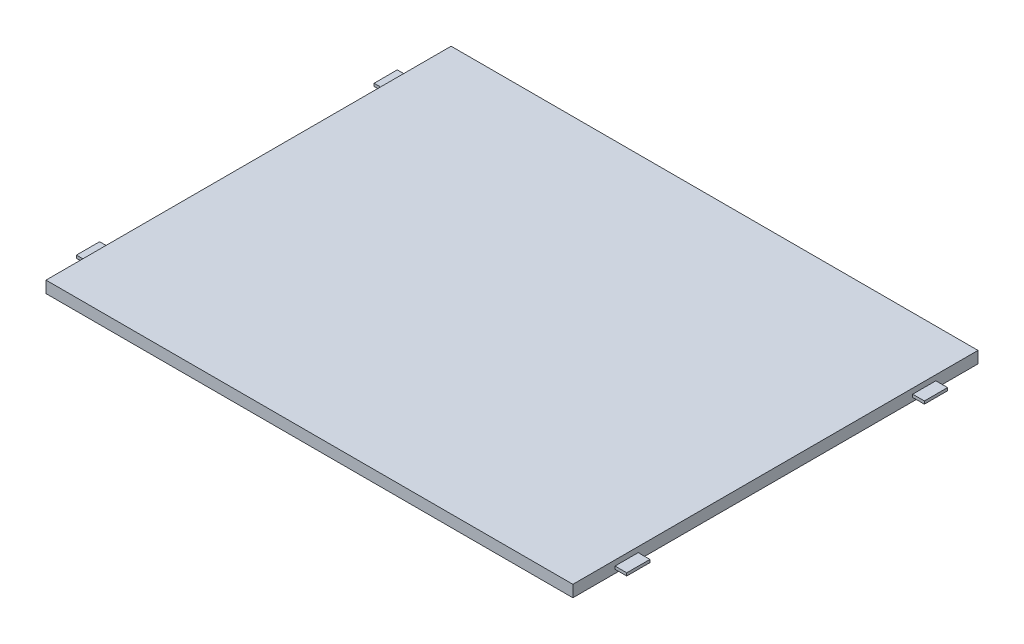
ISO-10303-21;
HEADER;
FILE_DESCRIPTION(('STEP AP214'),'2;1');
FILE_NAME('part.step','',(''),(''),'','','');
FILE_SCHEMA(('AUTOMOTIVE_DESIGN { 1 0 10303 214 1 1 1 1 }'));
ENDSEC;
DATA;
#1=APPLICATION_CONTEXT('core data for automotive mechanical design processes');
#2=APPLICATION_PROTOCOL_DEFINITION('international standard','automotive_design',2000,#1);
#3=PRODUCT_CONTEXT('',#1,'mechanical');
#4=PRODUCT('Part','Part','',(#3));
#5=PRODUCT_RELATED_PRODUCT_CATEGORY('part','',(#4));
#6=PRODUCT_DEFINITION_FORMATION('','',#4);
#7=PRODUCT_DEFINITION_CONTEXT('part definition',#1,'design');
#8=PRODUCT_DEFINITION('design','',#6,#7);
#9=PRODUCT_DEFINITION_SHAPE('','',#8);
#10=(LENGTH_UNIT() NAMED_UNIT(*) SI_UNIT(.MILLI.,.METRE.));
#11=(NAMED_UNIT(*) PLANE_ANGLE_UNIT() SI_UNIT($,.RADIAN.));
#12=(NAMED_UNIT(*) SI_UNIT($,.STERADIAN.) SOLID_ANGLE_UNIT());
#13=UNCERTAINTY_MEASURE_WITH_UNIT(LENGTH_MEASURE(1.E-05),#10,'distance_accuracy_value','');
#14=(GEOMETRIC_REPRESENTATION_CONTEXT(3) GLOBAL_UNCERTAINTY_ASSIGNED_CONTEXT((#13)) GLOBAL_UNIT_ASSIGNED_CONTEXT((#10,
#11,#12)) REPRESENTATION_CONTEXT('',''));
#15=CARTESIAN_POINT('',(0.,0.,0.));
#16=DIRECTION('',(0.,0.,1.));
#17=DIRECTION('',(1.,0.,0.));
#18=AXIS2_PLACEMENT_3D('',#15,#16,#17);
#19=CARTESIAN_POINT('',(225.,5.,0.));
#20=DIRECTION('',(-1.,0.,0.));
#21=DIRECTION('',(0.,0.,1.));
#22=AXIS2_PLACEMENT_3D('',#19,#20,#21);
#23=PLANE('',#22);
#24=DIRECTION('',(0.,1.,0.));
#25=VECTOR('',#24,1.);
#26=CARTESIAN_POINT('',(225.,1.55,-27.9));
#27=LINE('',#26,#25);
#28=CARTESIAN_POINT('',(225.,1.55,-27.9));
#29=VERTEX_POINT('',#28);
#30=CARTESIAN_POINT('',(225.,2.75,-27.9));
#31=VERTEX_POINT('',#30);
#32=EDGE_CURVE('E243',#29,#31,#27,.T.);
#33=ORIENTED_EDGE('',*,*,#32,.F.);
#34=DIRECTION('',(0.,0.,-1.));
#35=VECTOR('',#34,1.);
#36=CARTESIAN_POINT('',(225.,1.55,-18.));
#37=LINE('',#36,#35);
#38=CARTESIAN_POINT('',(225.,1.55,-18.));
#39=VERTEX_POINT('',#38);
#40=EDGE_CURVE('E260',#39,#29,#37,.T.);
#41=ORIENTED_EDGE('',*,*,#40,.F.);
#42=DIRECTION('',(0.,-1.,0.));
#43=VECTOR('',#42,1.);
#44=CARTESIAN_POINT('',(225.,2.75,-18.));
#45=LINE('',#44,#43);
#46=CARTESIAN_POINT('',(225.,2.75,-18.));
#47=VERTEX_POINT('',#46);
#48=EDGE_CURVE('E273',#47,#39,#45,.T.);
#49=ORIENTED_EDGE('',*,*,#48,.F.);
#50=DIRECTION('',(0.,0.,1.));
#51=VECTOR('',#50,1.);
#52=CARTESIAN_POINT('',(225.,2.75,-27.9));
#53=LINE('',#52,#51);
#54=EDGE_CURVE('E248',#31,#47,#53,.T.);
#55=ORIENTED_EDGE('',*,*,#54,.F.);
#56=EDGE_LOOP('',(#33,#41,#49,#55));
#57=FACE_BOUND('',#56,.T.);
#58=DIRECTION('',(0.,0.,-1.));
#59=VECTOR('',#58,1.);
#60=CARTESIAN_POINT('',(225.,0.,0.));
#61=LINE('',#60,#59);
#62=CARTESIAN_POINT('',(225.,0.,0.));
#63=VERTEX_POINT('',#62);
#64=CARTESIAN_POINT('',(225.,0.,-173.));
#65=VERTEX_POINT('',#64);
#66=EDGE_CURVE('E407',#63,#65,#61,.T.);
#67=ORIENTED_EDGE('',*,*,#66,.T.);
#68=DIRECTION('',(0.,-1.,0.));
#69=VECTOR('',#68,1.);
#70=CARTESIAN_POINT('',(225.,5.,-173.));
#71=LINE('',#70,#69);
#72=CARTESIAN_POINT('',(225.,5.,-173.));
#73=VERTEX_POINT('',#72);
#74=EDGE_CURVE('E415',#73,#65,#71,.T.);
#75=ORIENTED_EDGE('',*,*,#74,.F.);
#76=DIRECTION('',(0.,0.,-1.));
#77=VECTOR('',#76,1.);
#78=CARTESIAN_POINT('',(225.,5.,0.));
#79=LINE('',#78,#77);
#80=CARTESIAN_POINT('',(225.,5.,0.));
#81=VERTEX_POINT('',#80);
#82=EDGE_CURVE('E394',#81,#73,#79,.T.);
#83=ORIENTED_EDGE('',*,*,#82,.F.);
#84=DIRECTION('',(0.,-1.,0.));
#85=VECTOR('',#84,1.);
#86=CARTESIAN_POINT('',(225.,5.,0.));
#87=LINE('',#86,#85);
#88=EDGE_CURVE('E50',#81,#63,#87,.T.);
#89=ORIENTED_EDGE('',*,*,#88,.T.);
#90=EDGE_LOOP('',(#67,#75,#83,#89));
#91=FACE_BOUND('',#90,.T.);
#92=DIRECTION('',(0.,-1.,0.));
#93=VECTOR('',#92,1.);
#94=CARTESIAN_POINT('',(225.,2.75,-145.1));
#95=LINE('',#94,#93);
#96=CARTESIAN_POINT('',(225.,2.75,-145.1));
#97=VERTEX_POINT('',#96);
#98=CARTESIAN_POINT('',(225.,1.55,-145.1));
#99=VERTEX_POINT('',#98);
#100=EDGE_CURVE('E241',#97,#99,#95,.T.);
#101=ORIENTED_EDGE('',*,*,#100,.F.);
#102=DIRECTION('',(0.,0.,1.));
#103=VECTOR('',#102,1.);
#104=CARTESIAN_POINT('',(225.,2.75,-155.));
#105=LINE('',#104,#103);
#106=CARTESIAN_POINT('',(225.,2.75,-155.));
#107=VERTEX_POINT('',#106);
#108=EDGE_CURVE('E238',#107,#97,#105,.T.);
#109=ORIENTED_EDGE('',*,*,#108,.F.);
#110=DIRECTION('',(0.,1.,0.));
#111=VECTOR('',#110,1.);
#112=CARTESIAN_POINT('',(225.,1.55,-155.));
#113=LINE('',#112,#111);
#114=CARTESIAN_POINT('',(225.,1.55,-155.));
#115=VERTEX_POINT('',#114);
#116=EDGE_CURVE('E68',#115,#107,#113,.T.);
#117=ORIENTED_EDGE('',*,*,#116,.F.);
#118=DIRECTION('',(0.,0.,-1.));
#119=VECTOR('',#118,1.);
#120=CARTESIAN_POINT('',(225.,1.55,-145.1));
#121=LINE('',#120,#119);
#122=EDGE_CURVE('E60',#99,#115,#121,.T.);
#123=ORIENTED_EDGE('',*,*,#122,.F.);
#124=EDGE_LOOP('',(#101,#109,#117,#123));
#125=FACE_BOUND('',#124,.T.);
#126=ADVANCED_FACE('F41',(#57,#91,#125),#23,.F.);
#127=CARTESIAN_POINT('',(0.,5.,0.));
#128=DIRECTION('',(1.,0.,0.));
#129=DIRECTION('',(0.,0.,-1.));
#130=AXIS2_PLACEMENT_3D('',#127,#128,#129);
#131=PLANE('',#130);
#132=DIRECTION('',(0.,1.,0.));
#133=VECTOR('',#132,1.);
#134=CARTESIAN_POINT('',(0.,2.75,-145.1));
#135=LINE('',#134,#133);
#136=CARTESIAN_POINT('',(0.,1.55,-145.1));
#137=VERTEX_POINT('',#136);
#138=CARTESIAN_POINT('',(0.,2.75,-145.1));
#139=VERTEX_POINT('',#138);
#140=EDGE_CURVE('E340',#137,#139,#135,.T.);
#141=ORIENTED_EDGE('',*,*,#140,.F.);
#142=DIRECTION('',(0.,0.,1.));
#143=VECTOR('',#142,1.);
#144=CARTESIAN_POINT('',(0.,1.55,-145.1));
#145=LINE('',#144,#143);
#146=CARTESIAN_POINT('',(0.,1.55,-155.));
#147=VERTEX_POINT('',#146);
#148=EDGE_CURVE('E346',#147,#137,#145,.T.);
#149=ORIENTED_EDGE('',*,*,#148,.F.);
#150=DIRECTION('',(0.,-1.,0.));
#151=VECTOR('',#150,1.);
#152=CARTESIAN_POINT('',(0.,2.75,-155.));
#153=LINE('',#152,#151);
#154=CARTESIAN_POINT('',(0.,2.75,-155.));
#155=VERTEX_POINT('',#154);
#156=EDGE_CURVE('E363',#155,#147,#153,.T.);
#157=ORIENTED_EDGE('',*,*,#156,.F.);
#158=DIRECTION('',(0.,0.,-1.));
#159=VECTOR('',#158,1.);
#160=CARTESIAN_POINT('',(0.,2.75,-145.1));
#161=LINE('',#160,#159);
#162=EDGE_CURVE('E359',#139,#155,#161,.T.);
#163=ORIENTED_EDGE('',*,*,#162,.F.);
#164=EDGE_LOOP('',(#141,#149,#157,#163));
#165=FACE_BOUND('',#164,.T.);
#166=DIRECTION('',(0.,0.,1.));
#167=VECTOR('',#166,1.);
#168=CARTESIAN_POINT('',(0.,0.,0.));
#169=LINE('',#168,#167);
#170=CARTESIAN_POINT('',(0.,0.,-173.));
#171=VERTEX_POINT('',#170);
#172=CARTESIAN_POINT('',(0.,0.,0.));
#173=VERTEX_POINT('',#172);
#174=EDGE_CURVE('E385',#171,#173,#169,.T.);
#175=ORIENTED_EDGE('',*,*,#174,.T.);
#176=DIRECTION('',(0.,-1.,0.));
#177=VECTOR('',#176,1.);
#178=CARTESIAN_POINT('',(0.,5.,0.));
#179=LINE('',#178,#177);
#180=CARTESIAN_POINT('',(0.,5.,0.));
#181=VERTEX_POINT('',#180);
#182=EDGE_CURVE('E11',#181,#173,#179,.T.);
#183=ORIENTED_EDGE('',*,*,#182,.F.);
#184=DIRECTION('',(0.,0.,1.));
#185=VECTOR('',#184,1.);
#186=CARTESIAN_POINT('',(0.,5.,0.));
#187=LINE('',#186,#185);
#188=CARTESIAN_POINT('',(0.,5.,-173.));
#189=VERTEX_POINT('',#188);
#190=EDGE_CURVE('E386',#189,#181,#187,.T.);
#191=ORIENTED_EDGE('',*,*,#190,.F.);
#192=DIRECTION('',(0.,-1.,0.));
#193=VECTOR('',#192,1.);
#194=CARTESIAN_POINT('',(0.,5.,-173.));
#195=LINE('',#194,#193);
#196=EDGE_CURVE('E400',#189,#171,#195,.T.);
#197=ORIENTED_EDGE('',*,*,#196,.T.);
#198=EDGE_LOOP('',(#175,#183,#191,#197));
#199=FACE_BOUND('',#198,.T.);
#200=DIRECTION('',(0.,-1.,0.));
#201=VECTOR('',#200,1.);
#202=CARTESIAN_POINT('',(0.,2.75,-27.9));
#203=LINE('',#202,#201);
#204=CARTESIAN_POINT('',(0.,2.75,-27.9));
#205=VERTEX_POINT('',#204);
#206=CARTESIAN_POINT('',(0.,1.55,-27.9));
#207=VERTEX_POINT('',#206);
#208=EDGE_CURVE('E295',#205,#207,#203,.T.);
#209=ORIENTED_EDGE('',*,*,#208,.F.);
#210=DIRECTION('',(0.,0.,-1.));
#211=VECTOR('',#210,1.);
#212=CARTESIAN_POINT('',(0.,2.75,-27.9));
#213=LINE('',#212,#211);
#214=CARTESIAN_POINT('',(0.,2.75,-18.));
#215=VERTEX_POINT('',#214);
#216=EDGE_CURVE('E301',#215,#205,#213,.T.);
#217=ORIENTED_EDGE('',*,*,#216,.F.);
#218=DIRECTION('',(0.,1.,0.));
#219=VECTOR('',#218,1.);
#220=CARTESIAN_POINT('',(0.,2.75,-18.));
#221=LINE('',#220,#219);
#222=CARTESIAN_POINT('',(0.,1.55,-18.));
#223=VERTEX_POINT('',#222);
#224=EDGE_CURVE('E318',#223,#215,#221,.T.);
#225=ORIENTED_EDGE('',*,*,#224,.F.);
#226=DIRECTION('',(0.,0.,1.));
#227=VECTOR('',#226,1.);
#228=CARTESIAN_POINT('',(0.,1.55,-27.9));
#229=LINE('',#228,#227);
#230=EDGE_CURVE('E314',#207,#223,#229,.T.);
#231=ORIENTED_EDGE('',*,*,#230,.F.);
#232=EDGE_LOOP('',(#209,#217,#225,#231));
#233=FACE_BOUND('',#232,.T.);
#234=ADVANCED_FACE('F43',(#165,#199,#233),#131,.F.);
#235=CARTESIAN_POINT('',(0.,5.,0.));
#236=DIRECTION('',(0.,0.,-1.));
#237=DIRECTION('',(-1.,0.,0.));
#238=AXIS2_PLACEMENT_3D('',#235,#236,#237);
#239=PLANE('',#238);
#240=DIRECTION('',(1.,0.,0.));
#241=VECTOR('',#240,1.);
#242=CARTESIAN_POINT('',(0.,0.,0.));
#243=LINE('',#242,#241);
#244=EDGE_CURVE('E404',#173,#63,#243,.T.);
#245=ORIENTED_EDGE('',*,*,#244,.T.);
#246=ORIENTED_EDGE('',*,*,#88,.F.);
#247=DIRECTION('',(1.,0.,0.));
#248=VECTOR('',#247,1.);
#249=CARTESIAN_POINT('',(0.,5.,0.));
#250=LINE('',#249,#248);
#251=EDGE_CURVE('E390',#181,#81,#250,.T.);
#252=ORIENTED_EDGE('',*,*,#251,.F.);
#253=ORIENTED_EDGE('',*,*,#182,.T.);
#254=EDGE_LOOP('',(#245,#246,#252,#253));
#255=FACE_BOUND('',#254,.T.);
#256=ADVANCED_FACE('F441',(#255),#239,.F.);
#257=CARTESIAN_POINT('',(0.,5.,-173.));
#258=DIRECTION('',(0.,0.,1.));
#259=DIRECTION('',(1.,0.,0.));
#260=AXIS2_PLACEMENT_3D('',#257,#258,#259);
#261=PLANE('',#260);
#262=DIRECTION('',(-1.,0.,0.));
#263=VECTOR('',#262,1.);
#264=CARTESIAN_POINT('',(0.,0.,-173.));
#265=LINE('',#264,#263);
#266=EDGE_CURVE('E391',#65,#171,#265,.T.);
#267=ORIENTED_EDGE('',*,*,#266,.T.);
#268=ORIENTED_EDGE('',*,*,#196,.F.);
#269=DIRECTION('',(-1.,0.,0.));
#270=VECTOR('',#269,1.);
#271=CARTESIAN_POINT('',(0.,5.,-173.));
#272=LINE('',#271,#270);
#273=EDGE_CURVE('E397',#73,#189,#272,.T.);
#274=ORIENTED_EDGE('',*,*,#273,.F.);
#275=ORIENTED_EDGE('',*,*,#74,.T.);
#276=EDGE_LOOP('',(#267,#268,#274,#275));
#277=FACE_BOUND('',#276,.T.);
#278=ADVANCED_FACE('F433',(#277),#261,.F.);
#279=CARTESIAN_POINT('',(0.,5.,0.));
#280=DIRECTION('',(0.,-1.,0.));
#281=DIRECTION('',(0.,0.,-1.));
#282=AXIS2_PLACEMENT_3D('',#279,#280,#281);
#283=PLANE('',#282);
#284=ORIENTED_EDGE('',*,*,#190,.T.);
#285=ORIENTED_EDGE('',*,*,#251,.T.);
#286=ORIENTED_EDGE('',*,*,#82,.T.);
#287=ORIENTED_EDGE('',*,*,#273,.T.);
#288=EDGE_LOOP('',(#284,#285,#286,#287));
#289=FACE_BOUND('',#288,.T.);
#290=ADVANCED_FACE('F440',(#289),#283,.F.);
#291=CARTESIAN_POINT('',(0.,0.,0.));
#292=DIRECTION('',(0.,-1.,0.));
#293=DIRECTION('',(0.,0.,-1.));
#294=AXIS2_PLACEMENT_3D('',#291,#292,#293);
#295=PLANE('',#294);
#296=ORIENTED_EDGE('',*,*,#174,.F.);
#297=ORIENTED_EDGE('',*,*,#266,.F.);
#298=ORIENTED_EDGE('',*,*,#66,.F.);
#299=ORIENTED_EDGE('',*,*,#244,.F.);
#300=EDGE_LOOP('',(#296,#297,#298,#299));
#301=FACE_BOUND('',#300,.T.);
#302=ADVANCED_FACE('F430',(#301),#295,.T.);
#303=CARTESIAN_POINT('',(-5.,2.75,-145.1));
#304=DIRECTION('',(0.,0.,-1.));
#305=DIRECTION('',(-1.,0.,0.));
#306=AXIS2_PLACEMENT_3D('',#303,#304,#305);
#307=PLANE('',#306);
#308=ORIENTED_EDGE('',*,*,#140,.T.);
#309=DIRECTION('',(1.,0.,0.));
#310=VECTOR('',#309,1.);
#311=CARTESIAN_POINT('',(-5.,2.75,-145.1));
#312=LINE('',#311,#310);
#313=CARTESIAN_POINT('',(-5.,2.75,-145.1));
#314=VERTEX_POINT('',#313);
#315=EDGE_CURVE('E381',#314,#139,#312,.T.);
#316=ORIENTED_EDGE('',*,*,#315,.F.);
#317=DIRECTION('',(0.,1.,0.));
#318=VECTOR('',#317,1.);
#319=CARTESIAN_POINT('',(-5.,2.75,-145.1));
#320=LINE('',#319,#318);
#321=CARTESIAN_POINT('',(-5.,1.55,-145.1));
#322=VERTEX_POINT('',#321);
#323=EDGE_CURVE('E341',#322,#314,#320,.T.);
#324=ORIENTED_EDGE('',*,*,#323,.F.);
#325=DIRECTION('',(1.,0.,0.));
#326=VECTOR('',#325,1.);
#327=CARTESIAN_POINT('',(-5.,1.55,-145.1));
#328=LINE('',#327,#326);
#329=EDGE_CURVE('E355',#322,#137,#328,.T.);
#330=ORIENTED_EDGE('',*,*,#329,.T.);
#331=EDGE_LOOP('',(#308,#316,#324,#330));
#332=FACE_BOUND('',#331,.T.);
#333=ADVANCED_FACE('F457',(#332),#307,.F.);
#334=CARTESIAN_POINT('',(-5.,2.75,-145.1));
#335=DIRECTION('',(0.,-1.,0.));
#336=DIRECTION('',(0.,0.,-1.));
#337=AXIS2_PLACEMENT_3D('',#334,#335,#336);
#338=PLANE('',#337);
#339=ORIENTED_EDGE('',*,*,#162,.T.);
#340=DIRECTION('',(1.,0.,0.));
#341=VECTOR('',#340,1.);
#342=CARTESIAN_POINT('',(-5.,2.75,-155.));
#343=LINE('',#342,#341);
#344=CARTESIAN_POINT('',(-5.,2.75,-155.));
#345=VERTEX_POINT('',#344);
#346=EDGE_CURVE('E377',#345,#155,#343,.T.);
#347=ORIENTED_EDGE('',*,*,#346,.F.);
#348=DIRECTION('',(0.,0.,-1.));
#349=VECTOR('',#348,1.);
#350=CARTESIAN_POINT('',(-5.,2.75,-145.1));
#351=LINE('',#350,#349);
#352=EDGE_CURVE('E345',#314,#345,#351,.T.);
#353=ORIENTED_EDGE('',*,*,#352,.F.);
#354=ORIENTED_EDGE('',*,*,#315,.T.);
#355=EDGE_LOOP('',(#339,#347,#353,#354));
#356=FACE_BOUND('',#355,.T.);
#357=ADVANCED_FACE('F462',(#356),#338,.F.);
#358=CARTESIAN_POINT('',(-5.,2.75,-155.));
#359=DIRECTION('',(0.,0.,1.));
#360=DIRECTION('',(1.,0.,0.));
#361=AXIS2_PLACEMENT_3D('',#358,#359,#360);
#362=PLANE('',#361);
#363=ORIENTED_EDGE('',*,*,#156,.T.);
#364=DIRECTION('',(1.,0.,0.));
#365=VECTOR('',#364,1.);
#366=CARTESIAN_POINT('',(-5.,1.55,-155.));
#367=LINE('',#366,#365);
#368=CARTESIAN_POINT('',(-5.,1.55,-155.));
#369=VERTEX_POINT('',#368);
#370=EDGE_CURVE('E373',#369,#147,#367,.T.);
#371=ORIENTED_EDGE('',*,*,#370,.F.);
#372=DIRECTION('',(0.,-1.,0.));
#373=VECTOR('',#372,1.);
#374=CARTESIAN_POINT('',(-5.,2.75,-155.));
#375=LINE('',#374,#373);
#376=EDGE_CURVE('E349',#345,#369,#375,.T.);
#377=ORIENTED_EDGE('',*,*,#376,.F.);
#378=ORIENTED_EDGE('',*,*,#346,.T.);
#379=EDGE_LOOP('',(#363,#371,#377,#378));
#380=FACE_BOUND('',#379,.T.);
#381=ADVANCED_FACE('F466',(#380),#362,.F.);
#382=CARTESIAN_POINT('',(-5.,1.55,-145.1));
#383=DIRECTION('',(0.,1.,0.));
#384=DIRECTION('',(0.,0.,1.));
#385=AXIS2_PLACEMENT_3D('',#382,#383,#384);
#386=PLANE('',#385);
#387=ORIENTED_EDGE('',*,*,#148,.T.);
#388=ORIENTED_EDGE('',*,*,#329,.F.);
#389=DIRECTION('',(0.,0.,1.));
#390=VECTOR('',#389,1.);
#391=CARTESIAN_POINT('',(-5.,1.55,-145.1));
#392=LINE('',#391,#390);
#393=EDGE_CURVE('E352',#369,#322,#392,.T.);
#394=ORIENTED_EDGE('',*,*,#393,.F.);
#395=ORIENTED_EDGE('',*,*,#370,.T.);
#396=EDGE_LOOP('',(#387,#388,#394,#395));
#397=FACE_BOUND('',#396,.T.);
#398=ADVANCED_FACE('F470',(#397),#386,.F.);
#399=CARTESIAN_POINT('',(-5.,0.,0.));
#400=DIRECTION('',(1.,0.,0.));
#401=DIRECTION('',(0.,0.,-1.));
#402=AXIS2_PLACEMENT_3D('',#399,#400,#401);
#403=PLANE('',#402);
#404=ORIENTED_EDGE('',*,*,#323,.T.);
#405=ORIENTED_EDGE('',*,*,#352,.T.);
#406=ORIENTED_EDGE('',*,*,#376,.T.);
#407=ORIENTED_EDGE('',*,*,#393,.T.);
#408=EDGE_LOOP('',(#404,#405,#406,#407));
#409=FACE_BOUND('',#408,.T.);
#410=ADVANCED_FACE('F474',(#409),#403,.F.);
#411=CARTESIAN_POINT('',(-5.,2.75,-27.9));
#412=DIRECTION('',(0.,0.,1.));
#413=DIRECTION('',(1.,0.,0.));
#414=AXIS2_PLACEMENT_3D('',#411,#412,#413);
#415=PLANE('',#414);
#416=ORIENTED_EDGE('',*,*,#208,.T.);
#417=DIRECTION('',(1.,0.,0.));
#418=VECTOR('',#417,1.);
#419=CARTESIAN_POINT('',(-5.,1.55,-27.9));
#420=LINE('',#419,#418);
#421=CARTESIAN_POINT('',(-5.,1.55,-27.9));
#422=VERTEX_POINT('',#421);
#423=EDGE_CURVE('E336',#422,#207,#420,.T.);
#424=ORIENTED_EDGE('',*,*,#423,.F.);
#425=DIRECTION('',(0.,-1.,0.));
#426=VECTOR('',#425,1.);
#427=CARTESIAN_POINT('',(-5.,2.75,-27.9));
#428=LINE('',#427,#426);
#429=CARTESIAN_POINT('',(-5.,2.75,-27.9));
#430=VERTEX_POINT('',#429);
#431=EDGE_CURVE('E296',#430,#422,#428,.T.);
#432=ORIENTED_EDGE('',*,*,#431,.F.);
#433=DIRECTION('',(1.,0.,0.));
#434=VECTOR('',#433,1.);
#435=CARTESIAN_POINT('',(-5.,2.75,-27.9));
#436=LINE('',#435,#434);
#437=EDGE_CURVE('E310',#430,#205,#436,.T.);
#438=ORIENTED_EDGE('',*,*,#437,.T.);
#439=EDGE_LOOP('',(#416,#424,#432,#438));
#440=FACE_BOUND('',#439,.T.);
#441=ADVANCED_FACE('F478',(#440),#415,.F.);
#442=CARTESIAN_POINT('',(-5.,1.55,-27.9));
#443=DIRECTION('',(0.,1.,0.));
#444=DIRECTION('',(0.,0.,1.));
#445=AXIS2_PLACEMENT_3D('',#442,#443,#444);
#446=PLANE('',#445);
#447=ORIENTED_EDGE('',*,*,#230,.T.);
#448=DIRECTION('',(1.,0.,0.));
#449=VECTOR('',#448,1.);
#450=CARTESIAN_POINT('',(-5.,1.55,-18.));
#451=LINE('',#450,#449);
#452=CARTESIAN_POINT('',(-5.,1.55,-18.));
#453=VERTEX_POINT('',#452);
#454=EDGE_CURVE('E332',#453,#223,#451,.T.);
#455=ORIENTED_EDGE('',*,*,#454,.F.);
#456=DIRECTION('',(0.,0.,1.));
#457=VECTOR('',#456,1.);
#458=CARTESIAN_POINT('',(-5.,1.55,-27.9));
#459=LINE('',#458,#457);
#460=EDGE_CURVE('E300',#422,#453,#459,.T.);
#461=ORIENTED_EDGE('',*,*,#460,.F.);
#462=ORIENTED_EDGE('',*,*,#423,.T.);
#463=EDGE_LOOP('',(#447,#455,#461,#462));
#464=FACE_BOUND('',#463,.T.);
#465=ADVANCED_FACE('F482',(#464),#446,.F.);
#466=CARTESIAN_POINT('',(-5.,2.75,-18.));
#467=DIRECTION('',(0.,0.,-1.));
#468=DIRECTION('',(-1.,0.,0.));
#469=AXIS2_PLACEMENT_3D('',#466,#467,#468);
#470=PLANE('',#469);
#471=ORIENTED_EDGE('',*,*,#224,.T.);
#472=DIRECTION('',(1.,0.,0.));
#473=VECTOR('',#472,1.);
#474=CARTESIAN_POINT('',(-5.,2.75,-18.));
#475=LINE('',#474,#473);
#476=CARTESIAN_POINT('',(-5.,2.75,-18.));
#477=VERTEX_POINT('',#476);
#478=EDGE_CURVE('E328',#477,#215,#475,.T.);
#479=ORIENTED_EDGE('',*,*,#478,.F.);
#480=DIRECTION('',(0.,1.,0.));
#481=VECTOR('',#480,1.);
#482=CARTESIAN_POINT('',(-5.,2.75,-18.));
#483=LINE('',#482,#481);
#484=EDGE_CURVE('E304',#453,#477,#483,.T.);
#485=ORIENTED_EDGE('',*,*,#484,.F.);
#486=ORIENTED_EDGE('',*,*,#454,.T.);
#487=EDGE_LOOP('',(#471,#479,#485,#486));
#488=FACE_BOUND('',#487,.T.);
#489=ADVANCED_FACE('F486',(#488),#470,.F.);
#490=CARTESIAN_POINT('',(-5.,2.75,-27.9));
#491=DIRECTION('',(0.,-1.,0.));
#492=DIRECTION('',(0.,0.,-1.));
#493=AXIS2_PLACEMENT_3D('',#490,#491,#492);
#494=PLANE('',#493);
#495=ORIENTED_EDGE('',*,*,#216,.T.);
#496=ORIENTED_EDGE('',*,*,#437,.F.);
#497=DIRECTION('',(0.,0.,-1.));
#498=VECTOR('',#497,1.);
#499=CARTESIAN_POINT('',(-5.,2.75,-27.9));
#500=LINE('',#499,#498);
#501=EDGE_CURVE('E307',#477,#430,#500,.T.);
#502=ORIENTED_EDGE('',*,*,#501,.F.);
#503=ORIENTED_EDGE('',*,*,#478,.T.);
#504=EDGE_LOOP('',(#495,#496,#502,#503));
#505=FACE_BOUND('',#504,.T.);
#506=ADVANCED_FACE('F490',(#505),#494,.F.);
#507=CARTESIAN_POINT('',(-5.,0.,0.));
#508=DIRECTION('',(-1.,0.,0.));
#509=DIRECTION('',(0.,0.,1.));
#510=AXIS2_PLACEMENT_3D('',#507,#508,#509);
#511=PLANE('',#510);
#512=ORIENTED_EDGE('',*,*,#431,.T.);
#513=ORIENTED_EDGE('',*,*,#460,.T.);
#514=ORIENTED_EDGE('',*,*,#484,.T.);
#515=ORIENTED_EDGE('',*,*,#501,.T.);
#516=EDGE_LOOP('',(#512,#513,#514,#515));
#517=FACE_BOUND('',#516,.T.);
#518=ADVANCED_FACE('F494',(#517),#511,.T.);
#519=CARTESIAN_POINT('',(230.,1.55,-27.9));
#520=DIRECTION('',(0.,0.,1.));
#521=DIRECTION('',(1.,0.,0.));
#522=AXIS2_PLACEMENT_3D('',#519,#520,#521);
#523=PLANE('',#522);
#524=ORIENTED_EDGE('',*,*,#32,.T.);
#525=DIRECTION('',(-1.,0.,0.));
#526=VECTOR('',#525,1.);
#527=CARTESIAN_POINT('',(230.,2.75,-27.9));
#528=LINE('',#527,#526);
#529=CARTESIAN_POINT('',(230.,2.75,-27.9));
#530=VERTEX_POINT('',#529);
#531=EDGE_CURVE('E291',#530,#31,#528,.T.);
#532=ORIENTED_EDGE('',*,*,#531,.F.);
#533=DIRECTION('',(0.,1.,0.));
#534=VECTOR('',#533,1.);
#535=CARTESIAN_POINT('',(230.,1.55,-27.9));
#536=LINE('',#535,#534);
#537=CARTESIAN_POINT('',(230.,1.55,-27.9));
#538=VERTEX_POINT('',#537);
#539=EDGE_CURVE('E255',#538,#530,#536,.T.);
#540=ORIENTED_EDGE('',*,*,#539,.F.);
#541=DIRECTION('',(-1.,0.,0.));
#542=VECTOR('',#541,1.);
#543=CARTESIAN_POINT('',(230.,1.55,-27.9));
#544=LINE('',#543,#542);
#545=EDGE_CURVE('E268',#538,#29,#544,.T.);
#546=ORIENTED_EDGE('',*,*,#545,.T.);
#547=EDGE_LOOP('',(#524,#532,#540,#546));
#548=FACE_BOUND('',#547,.T.);
#549=ADVANCED_FACE('F498',(#548),#523,.F.);
#550=CARTESIAN_POINT('',(230.,2.75,-27.9));
#551=DIRECTION('',(0.,-1.,0.));
#552=DIRECTION('',(0.,0.,-1.));
#553=AXIS2_PLACEMENT_3D('',#550,#551,#552);
#554=PLANE('',#553);
#555=ORIENTED_EDGE('',*,*,#54,.T.);
#556=DIRECTION('',(-1.,0.,0.));
#557=VECTOR('',#556,1.);
#558=CARTESIAN_POINT('',(230.,2.75,-18.));
#559=LINE('',#558,#557);
#560=CARTESIAN_POINT('',(230.,2.75,-18.));
#561=VERTEX_POINT('',#560);
#562=EDGE_CURVE('E287',#561,#47,#559,.T.);
#563=ORIENTED_EDGE('',*,*,#562,.F.);
#564=DIRECTION('',(0.,0.,1.));
#565=VECTOR('',#564,1.);
#566=CARTESIAN_POINT('',(230.,2.75,-27.9));
#567=LINE('',#566,#565);
#568=EDGE_CURVE('E259',#530,#561,#567,.T.);
#569=ORIENTED_EDGE('',*,*,#568,.F.);
#570=ORIENTED_EDGE('',*,*,#531,.T.);
#571=EDGE_LOOP('',(#555,#563,#569,#570));
#572=FACE_BOUND('',#571,.T.);
#573=ADVANCED_FACE('F502',(#572),#554,.F.);
#574=CARTESIAN_POINT('',(230.,2.75,-18.));
#575=DIRECTION('',(0.,0.,-1.));
#576=DIRECTION('',(-1.,0.,0.));
#577=AXIS2_PLACEMENT_3D('',#574,#575,#576);
#578=PLANE('',#577);
#579=ORIENTED_EDGE('',*,*,#48,.T.);
#580=DIRECTION('',(-1.,0.,0.));
#581=VECTOR('',#580,1.);
#582=CARTESIAN_POINT('',(230.,1.55,-18.));
#583=LINE('',#582,#581);
#584=CARTESIAN_POINT('',(230.,1.55,-18.));
#585=VERTEX_POINT('',#584);
#586=EDGE_CURVE('E283',#585,#39,#583,.T.);
#587=ORIENTED_EDGE('',*,*,#586,.F.);
#588=DIRECTION('',(0.,-1.,0.));
#589=VECTOR('',#588,1.);
#590=CARTESIAN_POINT('',(230.,2.75,-18.));
#591=LINE('',#590,#589);
#592=EDGE_CURVE('E263',#561,#585,#591,.T.);
#593=ORIENTED_EDGE('',*,*,#592,.F.);
#594=ORIENTED_EDGE('',*,*,#562,.T.);
#595=EDGE_LOOP('',(#579,#587,#593,#594));
#596=FACE_BOUND('',#595,.T.);
#597=ADVANCED_FACE('F506',(#596),#578,.F.);
#598=CARTESIAN_POINT('',(230.,1.55,-18.));
#599=DIRECTION('',(0.,1.,0.));
#600=DIRECTION('',(0.,0.,1.));
#601=AXIS2_PLACEMENT_3D('',#598,#599,#600);
#602=PLANE('',#601);
#603=ORIENTED_EDGE('',*,*,#40,.T.);
#604=ORIENTED_EDGE('',*,*,#545,.F.);
#605=DIRECTION('',(0.,0.,-1.));
#606=VECTOR('',#605,1.);
#607=CARTESIAN_POINT('',(230.,1.55,-18.));
#608=LINE('',#607,#606);
#609=EDGE_CURVE('E266',#585,#538,#608,.T.);
#610=ORIENTED_EDGE('',*,*,#609,.F.);
#611=ORIENTED_EDGE('',*,*,#586,.T.);
#612=EDGE_LOOP('',(#603,#604,#610,#611));
#613=FACE_BOUND('',#612,.T.);
#614=ADVANCED_FACE('F510',(#613),#602,.F.);
#615=CARTESIAN_POINT('',(230.,0.,0.));
#616=DIRECTION('',(1.,0.,0.));
#617=DIRECTION('',(0.,0.,-1.));
#618=AXIS2_PLACEMENT_3D('',#615,#616,#617);
#619=PLANE('',#618);
#620=ORIENTED_EDGE('',*,*,#539,.T.);
#621=ORIENTED_EDGE('',*,*,#568,.T.);
#622=ORIENTED_EDGE('',*,*,#592,.T.);
#623=ORIENTED_EDGE('',*,*,#609,.T.);
#624=EDGE_LOOP('',(#620,#621,#622,#623));
#625=FACE_BOUND('',#624,.T.);
#626=ADVANCED_FACE('F514',(#625),#619,.T.);
#627=CARTESIAN_POINT('',(230.,2.75,-145.1));
#628=DIRECTION('',(0.,0.,-1.));
#629=DIRECTION('',(-1.,0.,0.));
#630=AXIS2_PLACEMENT_3D('',#627,#628,#629);
#631=PLANE('',#630);
#632=ORIENTED_EDGE('',*,*,#100,.T.);
#633=DIRECTION('',(-1.,0.,0.));
#634=VECTOR('',#633,1.);
#635=CARTESIAN_POINT('',(230.,1.55,-145.1));
#636=LINE('',#635,#634);
#637=CARTESIAN_POINT('',(230.,1.55,-145.1));
#638=VERTEX_POINT('',#637);
#639=EDGE_CURVE('E220',#638,#99,#636,.T.);
#640=ORIENTED_EDGE('',*,*,#639,.F.);
#641=DIRECTION('',(0.,-1.,0.));
#642=VECTOR('',#641,1.);
#643=CARTESIAN_POINT('',(230.,2.75,-145.1));
#644=LINE('',#643,#642);
#645=CARTESIAN_POINT('',(230.,2.75,-145.1));
#646=VERTEX_POINT('',#645);
#647=EDGE_CURVE('E228',#646,#638,#644,.T.);
#648=ORIENTED_EDGE('',*,*,#647,.F.);
#649=DIRECTION('',(-1.,0.,0.));
#650=VECTOR('',#649,1.);
#651=CARTESIAN_POINT('',(230.,2.75,-145.1));
#652=LINE('',#651,#650);
#653=EDGE_CURVE('E760',#646,#97,#652,.T.);
#654=ORIENTED_EDGE('',*,*,#653,.T.);
#655=EDGE_LOOP('',(#632,#640,#648,#654));
#656=FACE_BOUND('',#655,.T.);
#657=ADVANCED_FACE('F240',(#656),#631,.F.);
#658=CARTESIAN_POINT('',(230.,1.55,-145.1));
#659=DIRECTION('',(0.,1.,0.));
#660=DIRECTION('',(0.,0.,1.));
#661=AXIS2_PLACEMENT_3D('',#658,#659,#660);
#662=PLANE('',#661);
#663=ORIENTED_EDGE('',*,*,#122,.T.);
#664=DIRECTION('',(-1.,0.,0.));
#665=VECTOR('',#664,1.);
#666=CARTESIAN_POINT('',(230.,1.55,-155.));
#667=LINE('',#666,#665);
#668=CARTESIAN_POINT('',(230.,1.55,-155.));
#669=VERTEX_POINT('',#668);
#670=EDGE_CURVE('E223',#669,#115,#667,.T.);
#671=ORIENTED_EDGE('',*,*,#670,.F.);
#672=DIRECTION('',(0.,0.,-1.));
#673=VECTOR('',#672,1.);
#674=CARTESIAN_POINT('',(230.,1.55,-145.1));
#675=LINE('',#674,#673);
#676=EDGE_CURVE('E216',#638,#669,#675,.T.);
#677=ORIENTED_EDGE('',*,*,#676,.F.);
#678=ORIENTED_EDGE('',*,*,#639,.T.);
#679=EDGE_LOOP('',(#663,#671,#677,#678));
#680=FACE_BOUND('',#679,.T.);
#681=ADVANCED_FACE('F218',(#680),#662,.F.);
#682=CARTESIAN_POINT('',(230.,1.55,-155.));
#683=DIRECTION('',(0.,0.,1.));
#684=DIRECTION('',(1.,0.,0.));
#685=AXIS2_PLACEMENT_3D('',#682,#683,#684);
#686=PLANE('',#685);
#687=ORIENTED_EDGE('',*,*,#116,.T.);
#688=DIRECTION('',(-1.,0.,0.));
#689=VECTOR('',#688,1.);
#690=CARTESIAN_POINT('',(230.,2.75,-155.));
#691=LINE('',#690,#689);
#692=CARTESIAN_POINT('',(230.,2.75,-155.));
#693=VERTEX_POINT('',#692);
#694=EDGE_CURVE('E251',#693,#107,#691,.T.);
#695=ORIENTED_EDGE('',*,*,#694,.F.);
#696=DIRECTION('',(0.,1.,0.));
#697=VECTOR('',#696,1.);
#698=CARTESIAN_POINT('',(230.,1.55,-155.));
#699=LINE('',#698,#697);
#700=EDGE_CURVE('E227',#669,#693,#699,.T.);
#701=ORIENTED_EDGE('',*,*,#700,.F.);
#702=ORIENTED_EDGE('',*,*,#670,.T.);
#703=EDGE_LOOP('',(#687,#695,#701,#702));
#704=FACE_BOUND('',#703,.T.);
#705=ADVANCED_FACE('F523',(#704),#686,.F.);
#706=CARTESIAN_POINT('',(230.,2.75,-155.));
#707=DIRECTION('',(0.,-1.,0.));
#708=DIRECTION('',(0.,0.,-1.));
#709=AXIS2_PLACEMENT_3D('',#706,#707,#708);
#710=PLANE('',#709);
#711=ORIENTED_EDGE('',*,*,#108,.T.);
#712=ORIENTED_EDGE('',*,*,#653,.F.);
#713=DIRECTION('',(0.,0.,1.));
#714=VECTOR('',#713,1.);
#715=CARTESIAN_POINT('',(230.,2.75,-155.));
#716=LINE('',#715,#714);
#717=EDGE_CURVE('E233',#693,#646,#716,.T.);
#718=ORIENTED_EDGE('',*,*,#717,.F.);
#719=ORIENTED_EDGE('',*,*,#694,.T.);
#720=EDGE_LOOP('',(#711,#712,#718,#719));
#721=FACE_BOUND('',#720,.T.);
#722=ADVANCED_FACE('F526',(#721),#710,.F.);
#723=CARTESIAN_POINT('',(230.,0.,0.));
#724=DIRECTION('',(1.,0.,0.));
#725=DIRECTION('',(0.,0.,-1.));
#726=AXIS2_PLACEMENT_3D('',#723,#724,#725);
#727=PLANE('',#726);
#728=ORIENTED_EDGE('',*,*,#647,.T.);
#729=ORIENTED_EDGE('',*,*,#676,.T.);
#730=ORIENTED_EDGE('',*,*,#700,.T.);
#731=ORIENTED_EDGE('',*,*,#717,.T.);
#732=EDGE_LOOP('',(#728,#729,#730,#731));
#733=FACE_BOUND('',#732,.T.);
#734=ADVANCED_FACE('F231',(#733),#727,.T.);
#735=CLOSED_SHELL('',(#126,#234,#256,#278,#290,#302,#333,#357,#381,#398,#410,#441,#465,#489,
#506,#518,#549,#573,#597,#614,#626,#657,#681,#705,#722,#734));
#736=MANIFOLD_SOLID_BREP('B2',#735);
#737=ADVANCED_BREP_SHAPE_REPRESENTATION('',(#18,#736),#14);
#738=SHAPE_DEFINITION_REPRESENTATION(#9,#737);
ENDSEC;
END-ISO-10303-21;
